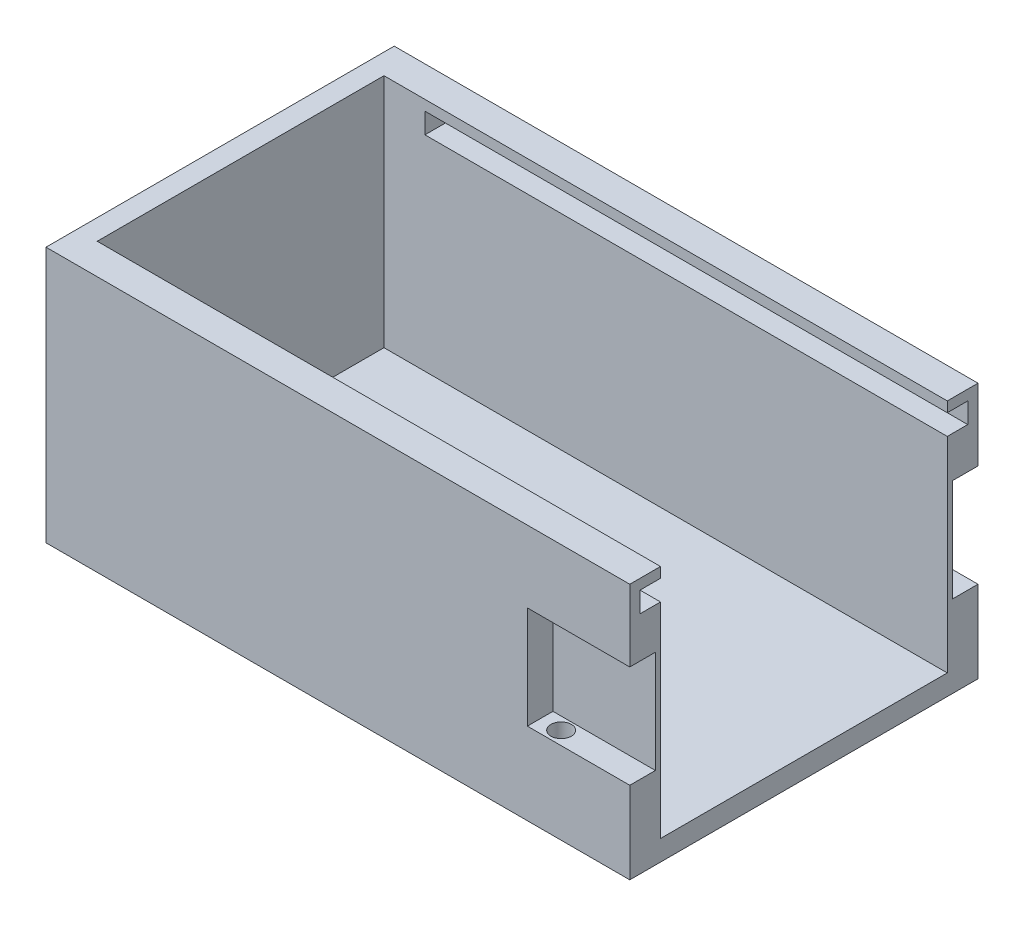
ISO-10303-21;
HEADER;
FILE_DESCRIPTION(('STEP AP214'),'2;1');
FILE_NAME('part.step','',(''),(''),'','','');
FILE_SCHEMA(('AUTOMOTIVE_DESIGN { 1 0 10303 214 1 1 1 1 }'));
ENDSEC;
DATA;
#1=APPLICATION_CONTEXT('core data for automotive mechanical design processes');
#2=APPLICATION_PROTOCOL_DEFINITION('international standard','automotive_design',2000,#1);
#3=PRODUCT_CONTEXT('',#1,'mechanical');
#4=PRODUCT('Part','Part','',(#3));
#5=PRODUCT_RELATED_PRODUCT_CATEGORY('part','',(#4));
#6=PRODUCT_DEFINITION_FORMATION('','',#4);
#7=PRODUCT_DEFINITION_CONTEXT('part definition',#1,'design');
#8=PRODUCT_DEFINITION('design','',#6,#7);
#9=PRODUCT_DEFINITION_SHAPE('','',#8);
#10=(LENGTH_UNIT() NAMED_UNIT(*) SI_UNIT(.MILLI.,.METRE.));
#11=(NAMED_UNIT(*) PLANE_ANGLE_UNIT() SI_UNIT($,.RADIAN.));
#12=(NAMED_UNIT(*) SI_UNIT($,.STERADIAN.) SOLID_ANGLE_UNIT());
#13=UNCERTAINTY_MEASURE_WITH_UNIT(LENGTH_MEASURE(1.E-05),#10,'distance_accuracy_value','');
#14=(GEOMETRIC_REPRESENTATION_CONTEXT(3) GLOBAL_UNCERTAINTY_ASSIGNED_CONTEXT((#13)) GLOBAL_UNIT_ASSIGNED_CONTEXT((#10,
#11,#12)) REPRESENTATION_CONTEXT('',''));
#15=CARTESIAN_POINT('',(0.,0.,0.));
#16=DIRECTION('',(0.,0.,1.));
#17=DIRECTION('',(1.,0.,0.));
#18=AXIS2_PLACEMENT_3D('',#15,#16,#17);
#19=CARTESIAN_POINT('',(0.,25.,0.));
#20=DIRECTION('',(0.,-1.,0.));
#21=DIRECTION('',(0.,0.,-1.));
#22=AXIS2_PLACEMENT_3D('',#19,#20,#21);
#23=PLANE('',#22);
#24=DIRECTION('',(1.,0.,0.));
#25=VECTOR('',#24,1.);
#26=CARTESIAN_POINT('',(0.,25.,0.));
#27=LINE('',#26,#25);
#28=CARTESIAN_POINT('',(0.,25.,0.));
#29=VERTEX_POINT('',#28);
#30=CARTESIAN_POINT('',(57.,25.,0.));
#31=VERTEX_POINT('',#30);
#32=EDGE_CURVE('E363',#29,#31,#27,.T.);
#33=ORIENTED_EDGE('',*,*,#32,.T.);
#34=DIRECTION('',(0.,0.,1.));
#35=VECTOR('',#34,1.);
#36=CARTESIAN_POINT('',(57.,25.,0.));
#37=LINE('',#36,#35);
#38=CARTESIAN_POINT('',(57.,25.,-3.));
#39=VERTEX_POINT('',#38);
#40=EDGE_CURVE('E281',#39,#31,#37,.T.);
#41=ORIENTED_EDGE('',*,*,#40,.F.);
#42=DIRECTION('',(1.,0.,0.));
#43=VECTOR('',#42,1.);
#44=CARTESIAN_POINT('',(2.,25.,-3.));
#45=LINE('',#44,#43);
#46=CARTESIAN_POINT('',(2.,25.,-3.));
#47=VERTEX_POINT('',#46);
#48=EDGE_CURVE('E342',#47,#39,#45,.T.);
#49=ORIENTED_EDGE('',*,*,#48,.F.);
#50=DIRECTION('',(0.,0.,1.));
#51=VECTOR('',#50,1.);
#52=CARTESIAN_POINT('',(2.,25.,-3.));
#53=LINE('',#52,#51);
#54=CARTESIAN_POINT('',(2.,25.,-31.));
#55=VERTEX_POINT('',#54);
#56=EDGE_CURVE('E339',#55,#47,#53,.T.);
#57=ORIENTED_EDGE('',*,*,#56,.F.);
#58=DIRECTION('',(-1.,0.,0.));
#59=VECTOR('',#58,1.);
#60=CARTESIAN_POINT('',(2.,25.,-31.));
#61=LINE('',#60,#59);
#62=CARTESIAN_POINT('',(57.,25.,-31.));
#63=VERTEX_POINT('',#62);
#64=EDGE_CURVE('E337',#63,#55,#61,.T.);
#65=ORIENTED_EDGE('',*,*,#64,.F.);
#66=CARTESIAN_POINT('',(57.,25.,-34.));
#67=VERTEX_POINT('',#66);
#68=EDGE_CURVE('E318',#67,#63,#37,.T.);
#69=ORIENTED_EDGE('',*,*,#68,.F.);
#70=DIRECTION('',(-1.,0.,0.));
#71=VECTOR('',#70,1.);
#72=CARTESIAN_POINT('',(0.,25.,-34.));
#73=LINE('',#72,#71);
#74=CARTESIAN_POINT('',(0.,25.,-34.));
#75=VERTEX_POINT('',#74);
#76=EDGE_CURVE('E367',#67,#75,#73,.T.);
#77=ORIENTED_EDGE('',*,*,#76,.T.);
#78=DIRECTION('',(0.,0.,1.));
#79=VECTOR('',#78,1.);
#80=CARTESIAN_POINT('',(0.,25.,0.));
#81=LINE('',#80,#79);
#82=EDGE_CURVE('E360',#75,#29,#81,.T.);
#83=ORIENTED_EDGE('',*,*,#82,.T.);
#84=EDGE_LOOP('',(#33,#41,#49,#57,#65,#69,#77,#83));
#85=FACE_BOUND('',#84,.T.);
#86=ADVANCED_FACE('F36',(#85),#23,.F.);
#87=CARTESIAN_POINT('',(0.,0.,0.));
#88=DIRECTION('',(0.,-1.,0.));
#89=DIRECTION('',(0.,0.,-1.));
#90=AXIS2_PLACEMENT_3D('',#87,#88,#89);
#91=PLANE('',#90);
#92=DIRECTION('',(0.,0.,1.));
#93=VECTOR('',#92,1.);
#94=CARTESIAN_POINT('',(57.,0.,0.));
#95=LINE('',#94,#93);
#96=CARTESIAN_POINT('',(57.,0.,-34.));
#97=VERTEX_POINT('',#96);
#98=CARTESIAN_POINT('',(57.,0.,0.));
#99=VERTEX_POINT('',#98);
#100=EDGE_CURVE('E314',#97,#99,#95,.T.);
#101=ORIENTED_EDGE('',*,*,#100,.T.);
#102=DIRECTION('',(1.,0.,0.));
#103=VECTOR('',#102,1.);
#104=CARTESIAN_POINT('',(0.,0.,0.));
#105=LINE('',#104,#103);
#106=CARTESIAN_POINT('',(0.,0.,0.));
#107=VERTEX_POINT('',#106);
#108=EDGE_CURVE('E371',#107,#99,#105,.T.);
#109=ORIENTED_EDGE('',*,*,#108,.F.);
#110=DIRECTION('',(0.,0.,1.));
#111=VECTOR('',#110,1.);
#112=CARTESIAN_POINT('',(0.,0.,0.));
#113=LINE('',#112,#111);
#114=CARTESIAN_POINT('',(0.,0.,-34.));
#115=VERTEX_POINT('',#114);
#116=EDGE_CURVE('E359',#115,#107,#113,.T.);
#117=ORIENTED_EDGE('',*,*,#116,.F.);
#118=DIRECTION('',(-1.,0.,0.));
#119=VECTOR('',#118,1.);
#120=CARTESIAN_POINT('',(0.,0.,-34.));
#121=LINE('',#120,#119);
#122=EDGE_CURVE('E364',#97,#115,#121,.T.);
#123=ORIENTED_EDGE('',*,*,#122,.F.);
#124=EDGE_LOOP('',(#101,#109,#117,#123));
#125=FACE_BOUND('',#124,.T.);
#126=ADVANCED_FACE('F412',(#125),#91,.T.);
#127=CARTESIAN_POINT('',(0.,25.,0.));
#128=DIRECTION('',(1.,0.,0.));
#129=DIRECTION('',(0.,0.,-1.));
#130=AXIS2_PLACEMENT_3D('',#127,#128,#129);
#131=PLANE('',#130);
#132=ORIENTED_EDGE('',*,*,#116,.T.);
#133=DIRECTION('',(0.,-1.,0.));
#134=VECTOR('',#133,1.);
#135=CARTESIAN_POINT('',(0.,25.,0.));
#136=LINE('',#135,#134);
#137=EDGE_CURVE('E11',#29,#107,#136,.T.);
#138=ORIENTED_EDGE('',*,*,#137,.F.);
#139=ORIENTED_EDGE('',*,*,#82,.F.);
#140=DIRECTION('',(0.,-1.,0.));
#141=VECTOR('',#140,1.);
#142=CARTESIAN_POINT('',(0.,25.,-34.));
#143=LINE('',#142,#141);
#144=EDGE_CURVE('E45',#75,#115,#143,.T.);
#145=ORIENTED_EDGE('',*,*,#144,.T.);
#146=EDGE_LOOP('',(#132,#138,#139,#145));
#147=FACE_BOUND('',#146,.T.);
#148=ADVANCED_FACE('F38',(#147),#131,.F.);
#149=CARTESIAN_POINT('',(0.,25.,0.));
#150=DIRECTION('',(0.,0.,-1.));
#151=DIRECTION('',(-1.,0.,0.));
#152=AXIS2_PLACEMENT_3D('',#149,#150,#151);
#153=PLANE('',#152);
#154=DIRECTION('',(0.,1.,0.));
#155=VECTOR('',#154,1.);
#156=CARTESIAN_POINT('',(57.,0.,0.));
#157=LINE('',#156,#155);
#158=CARTESIAN_POINT('',(57.,8.,0.));
#159=VERTEX_POINT('',#158);
#160=EDGE_CURVE('E320',#99,#159,#157,.T.);
#161=ORIENTED_EDGE('',*,*,#160,.T.);
#162=DIRECTION('',(1.,0.,0.));
#163=VECTOR('',#162,1.);
#164=CARTESIAN_POINT('',(57.,8.,0.));
#165=LINE('',#164,#163);
#166=CARTESIAN_POINT('',(47.,8.,0.));
#167=VERTEX_POINT('',#166);
#168=EDGE_CURVE('E217',#167,#159,#165,.T.);
#169=ORIENTED_EDGE('',*,*,#168,.F.);
#170=DIRECTION('',(0.,-1.,0.));
#171=VECTOR('',#170,1.);
#172=CARTESIAN_POINT('',(47.,18.,0.));
#173=LINE('',#172,#171);
#174=CARTESIAN_POINT('',(47.,18.,0.));
#175=VERTEX_POINT('',#174);
#176=EDGE_CURVE('E397',#175,#167,#173,.T.);
#177=ORIENTED_EDGE('',*,*,#176,.F.);
#178=DIRECTION('',(-1.,0.,0.));
#179=VECTOR('',#178,1.);
#180=CARTESIAN_POINT('',(57.,18.,0.));
#181=LINE('',#180,#179);
#182=CARTESIAN_POINT('',(57.,18.,0.));
#183=VERTEX_POINT('',#182);
#184=EDGE_CURVE('E383',#183,#175,#181,.T.);
#185=ORIENTED_EDGE('',*,*,#184,.F.);
#186=EDGE_CURVE('E222',#183,#31,#157,.T.);
#187=ORIENTED_EDGE('',*,*,#186,.T.);
#188=ORIENTED_EDGE('',*,*,#32,.F.);
#189=ORIENTED_EDGE('',*,*,#137,.T.);
#190=ORIENTED_EDGE('',*,*,#108,.T.);
#191=EDGE_LOOP('',(#161,#169,#177,#185,#187,#188,#189,#190));
#192=FACE_BOUND('',#191,.T.);
#193=ADVANCED_FACE('F408',(#192),#153,.F.);
#194=CARTESIAN_POINT('',(0.,25.,-34.));
#195=DIRECTION('',(0.,0.,1.));
#196=DIRECTION('',(1.,0.,0.));
#197=AXIS2_PLACEMENT_3D('',#194,#195,#196);
#198=PLANE('',#197);
#199=DIRECTION('',(0.,1.,0.));
#200=VECTOR('',#199,1.);
#201=CARTESIAN_POINT('',(57.,0.,-34.));
#202=LINE('',#201,#200);
#203=CARTESIAN_POINT('',(57.,18.,-34.));
#204=VERTEX_POINT('',#203);
#205=EDGE_CURVE('E317',#204,#67,#202,.T.);
#206=ORIENTED_EDGE('',*,*,#205,.F.);
#207=DIRECTION('',(1.,0.,0.));
#208=VECTOR('',#207,1.);
#209=CARTESIAN_POINT('',(57.,18.,-34.));
#210=LINE('',#209,#208);
#211=CARTESIAN_POINT('',(47.,18.,-34.));
#212=VERTEX_POINT('',#211);
#213=EDGE_CURVE('E232',#212,#204,#210,.T.);
#214=ORIENTED_EDGE('',*,*,#213,.F.);
#215=DIRECTION('',(0.,1.,0.));
#216=VECTOR('',#215,1.);
#217=CARTESIAN_POINT('',(47.,18.,-34.));
#218=LINE('',#217,#216);
#219=CARTESIAN_POINT('',(47.,8.,-34.));
#220=VERTEX_POINT('',#219);
#221=EDGE_CURVE('E242',#220,#212,#218,.T.);
#222=ORIENTED_EDGE('',*,*,#221,.F.);
#223=DIRECTION('',(-1.,0.,0.));
#224=VECTOR('',#223,1.);
#225=CARTESIAN_POINT('',(57.,8.,-34.));
#226=LINE('',#225,#224);
#227=CARTESIAN_POINT('',(57.,8.,-34.));
#228=VERTEX_POINT('',#227);
#229=EDGE_CURVE('E239',#228,#220,#226,.T.);
#230=ORIENTED_EDGE('',*,*,#229,.F.);
#231=EDGE_CURVE('E324',#97,#228,#202,.T.);
#232=ORIENTED_EDGE('',*,*,#231,.F.);
#233=ORIENTED_EDGE('',*,*,#122,.T.);
#234=ORIENTED_EDGE('',*,*,#144,.F.);
#235=ORIENTED_EDGE('',*,*,#76,.F.);
#236=EDGE_LOOP('',(#206,#214,#222,#230,#232,#233,#234,#235));
#237=FACE_BOUND('',#236,.T.);
#238=ADVANCED_FACE('F417',(#237),#198,.F.);
#239=CARTESIAN_POINT('',(2.,25.,-31.));
#240=DIRECTION('',(0.,0.,1.));
#241=DIRECTION('',(1.,0.,0.));
#242=AXIS2_PLACEMENT_3D('',#239,#240,#241);
#243=PLANE('',#242);
#244=DIRECTION('',(1.,0.,0.));
#245=VECTOR('',#244,1.);
#246=CARTESIAN_POINT('',(6.,24.,-31.));
#247=LINE('',#246,#245);
#248=CARTESIAN_POINT('',(6.,24.,-31.));
#249=VERTEX_POINT('',#248);
#250=CARTESIAN_POINT('',(57.,24.,-31.));
#251=VERTEX_POINT('',#250);
#252=EDGE_CURVE('E274',#249,#251,#247,.T.);
#253=ORIENTED_EDGE('',*,*,#252,.T.);
#254=DIRECTION('',(0.,-1.,0.));
#255=VECTOR('',#254,1.);
#256=CARTESIAN_POINT('',(57.,25.,-31.));
#257=LINE('',#256,#255);
#258=EDGE_CURVE('E356',#63,#251,#257,.T.);
#259=ORIENTED_EDGE('',*,*,#258,.F.);
#260=ORIENTED_EDGE('',*,*,#64,.T.);
#261=DIRECTION('',(0.,-1.,0.));
#262=VECTOR('',#261,1.);
#263=CARTESIAN_POINT('',(2.,25.,-31.));
#264=LINE('',#263,#262);
#265=CARTESIAN_POINT('',(2.,2.,-31.));
#266=VERTEX_POINT('',#265);
#267=EDGE_CURVE('E352',#55,#266,#264,.T.);
#268=ORIENTED_EDGE('',*,*,#267,.T.);
#269=DIRECTION('',(1.,0.,0.));
#270=VECTOR('',#269,1.);
#271=CARTESIAN_POINT('',(2.,2.,-31.));
#272=LINE('',#271,#270);
#273=CARTESIAN_POINT('',(57.,2.,-31.));
#274=VERTEX_POINT('',#273);
#275=EDGE_CURVE('E332',#266,#274,#272,.T.);
#276=ORIENTED_EDGE('',*,*,#275,.T.);
#277=CARTESIAN_POINT('',(57.,22.,-31.));
#278=VERTEX_POINT('',#277);
#279=EDGE_CURVE('E355',#278,#274,#257,.T.);
#280=ORIENTED_EDGE('',*,*,#279,.F.);
#281=DIRECTION('',(1.,0.,0.));
#282=VECTOR('',#281,1.);
#283=CARTESIAN_POINT('',(6.,22.,-31.));
#284=LINE('',#283,#282);
#285=CARTESIAN_POINT('',(6.,22.,-31.));
#286=VERTEX_POINT('',#285);
#287=EDGE_CURVE('E300',#286,#278,#284,.T.);
#288=ORIENTED_EDGE('',*,*,#287,.F.);
#289=DIRECTION('',(0.,-1.,0.));
#290=VECTOR('',#289,1.);
#291=CARTESIAN_POINT('',(6.,24.,-31.));
#292=LINE('',#291,#290);
#293=EDGE_CURVE('E287',#249,#286,#292,.T.);
#294=ORIENTED_EDGE('',*,*,#293,.F.);
#295=EDGE_LOOP('',(#253,#259,#260,#268,#276,#280,#288,#294));
#296=FACE_BOUND('',#295,.T.);
#297=ADVANCED_FACE('F459',(#296),#243,.T.);
#298=CARTESIAN_POINT('',(2.,25.,-3.));
#299=DIRECTION('',(1.,0.,0.));
#300=DIRECTION('',(0.,0.,-1.));
#301=AXIS2_PLACEMENT_3D('',#298,#299,#300);
#302=PLANE('',#301);
#303=DIRECTION('',(0.,0.,-1.));
#304=VECTOR('',#303,1.);
#305=CARTESIAN_POINT('',(2.,2.,-3.));
#306=LINE('',#305,#304);
#307=CARTESIAN_POINT('',(2.,2.,-3.));
#308=VERTEX_POINT('',#307);
#309=EDGE_CURVE('E335',#308,#266,#306,.T.);
#310=ORIENTED_EDGE('',*,*,#309,.T.);
#311=ORIENTED_EDGE('',*,*,#267,.F.);
#312=ORIENTED_EDGE('',*,*,#56,.T.);
#313=DIRECTION('',(0.,-1.,0.));
#314=VECTOR('',#313,1.);
#315=CARTESIAN_POINT('',(2.,25.,-3.));
#316=LINE('',#315,#314);
#317=EDGE_CURVE('E349',#47,#308,#316,.T.);
#318=ORIENTED_EDGE('',*,*,#317,.T.);
#319=EDGE_LOOP('',(#310,#311,#312,#318));
#320=FACE_BOUND('',#319,.T.);
#321=ADVANCED_FACE('F501',(#320),#302,.T.);
#322=CARTESIAN_POINT('',(2.,25.,-3.));
#323=DIRECTION('',(0.,0.,-1.));
#324=DIRECTION('',(-1.,0.,0.));
#325=AXIS2_PLACEMENT_3D('',#322,#323,#324);
#326=PLANE('',#325);
#327=DIRECTION('',(1.,0.,0.));
#328=VECTOR('',#327,1.);
#329=CARTESIAN_POINT('',(6.,22.,-3.));
#330=LINE('',#329,#328);
#331=CARTESIAN_POINT('',(6.,22.,-3.));
#332=VERTEX_POINT('',#331);
#333=CARTESIAN_POINT('',(57.,22.,-3.));
#334=VERTEX_POINT('',#333);
#335=EDGE_CURVE('E278',#332,#334,#330,.T.);
#336=ORIENTED_EDGE('',*,*,#335,.T.);
#337=DIRECTION('',(0.,-1.,0.));
#338=VECTOR('',#337,1.);
#339=CARTESIAN_POINT('',(57.,25.,-3.));
#340=LINE('',#339,#338);
#341=CARTESIAN_POINT('',(57.,2.,-3.));
#342=VERTEX_POINT('',#341);
#343=EDGE_CURVE('E345',#334,#342,#340,.T.);
#344=ORIENTED_EDGE('',*,*,#343,.T.);
#345=DIRECTION('',(1.,0.,0.));
#346=VECTOR('',#345,1.);
#347=CARTESIAN_POINT('',(2.,2.,-3.));
#348=LINE('',#347,#346);
#349=EDGE_CURVE('E323',#308,#342,#348,.T.);
#350=ORIENTED_EDGE('',*,*,#349,.F.);
#351=ORIENTED_EDGE('',*,*,#317,.F.);
#352=ORIENTED_EDGE('',*,*,#48,.T.);
#353=CARTESIAN_POINT('',(57.,24.,-3.));
#354=VERTEX_POINT('',#353);
#355=EDGE_CURVE('E346',#39,#354,#340,.T.);
#356=ORIENTED_EDGE('',*,*,#355,.T.);
#357=DIRECTION('',(1.,0.,0.));
#358=VECTOR('',#357,1.);
#359=CARTESIAN_POINT('',(6.,24.,-3.));
#360=LINE('',#359,#358);
#361=CARTESIAN_POINT('',(6.,24.,-3.));
#362=VERTEX_POINT('',#361);
#363=EDGE_CURVE('E269',#362,#354,#360,.T.);
#364=ORIENTED_EDGE('',*,*,#363,.F.);
#365=DIRECTION('',(0.,1.,0.));
#366=VECTOR('',#365,1.);
#367=CARTESIAN_POINT('',(6.,24.,-3.));
#368=LINE('',#367,#366);
#369=EDGE_CURVE('E256',#332,#362,#368,.T.);
#370=ORIENTED_EDGE('',*,*,#369,.F.);
#371=EDGE_LOOP('',(#336,#344,#350,#351,#352,#356,#364,#370));
#372=FACE_BOUND('',#371,.T.);
#373=ADVANCED_FACE('F488',(#372),#326,.T.);
#374=CARTESIAN_POINT('',(0.,2.,0.));
#375=DIRECTION('',(0.,1.,0.));
#376=DIRECTION('',(0.,0.,1.));
#377=AXIS2_PLACEMENT_3D('',#374,#375,#376);
#378=PLANE('',#377);
#379=ORIENTED_EDGE('',*,*,#349,.T.);
#380=DIRECTION('',(0.,0.,-1.));
#381=VECTOR('',#380,1.);
#382=CARTESIAN_POINT('',(57.,2.,-3.));
#383=LINE('',#382,#381);
#384=EDGE_CURVE('E329',#342,#274,#383,.T.);
#385=ORIENTED_EDGE('',*,*,#384,.T.);
#386=ORIENTED_EDGE('',*,*,#275,.F.);
#387=ORIENTED_EDGE('',*,*,#309,.F.);
#388=EDGE_LOOP('',(#379,#385,#386,#387));
#389=FACE_BOUND('',#388,.T.);
#390=ADVANCED_FACE('F484',(#389),#378,.T.);
#391=CARTESIAN_POINT('',(57.,0.,0.));
#392=DIRECTION('',(-1.,0.,0.));
#393=DIRECTION('',(0.,0.,1.));
#394=AXIS2_PLACEMENT_3D('',#391,#392,#393);
#395=PLANE('',#394);
#396=DIRECTION('',(0.,1.,0.));
#397=VECTOR('',#396,1.);
#398=CARTESIAN_POINT('',(57.,18.,-2.5));
#399=LINE('',#398,#397);
#400=CARTESIAN_POINT('',(57.,8.,-2.5));
#401=VERTEX_POINT('',#400);
#402=CARTESIAN_POINT('',(57.,18.,-2.5));
#403=VERTEX_POINT('',#402);
#404=EDGE_CURVE('E211',#401,#403,#399,.T.);
#405=ORIENTED_EDGE('',*,*,#404,.F.);
#406=DIRECTION('',(0.,0.,1.));
#407=VECTOR('',#406,1.);
#408=CARTESIAN_POINT('',(57.,8.,-2.5));
#409=LINE('',#408,#407);
#410=EDGE_CURVE('E243',#401,#159,#409,.T.);
#411=ORIENTED_EDGE('',*,*,#410,.T.);
#412=ORIENTED_EDGE('',*,*,#160,.F.);
#413=ORIENTED_EDGE('',*,*,#100,.F.);
#414=ORIENTED_EDGE('',*,*,#231,.T.);
#415=DIRECTION('',(0.,0.,-1.));
#416=VECTOR('',#415,1.);
#417=CARTESIAN_POINT('',(57.,8.,-31.5));
#418=LINE('',#417,#416);
#419=CARTESIAN_POINT('',(57.,8.,-31.5));
#420=VERTEX_POINT('',#419);
#421=EDGE_CURVE('E238',#420,#228,#418,.T.);
#422=ORIENTED_EDGE('',*,*,#421,.F.);
#423=DIRECTION('',(0.,-1.,0.));
#424=VECTOR('',#423,1.);
#425=CARTESIAN_POINT('',(57.,18.,-31.5));
#426=LINE('',#425,#424);
#427=CARTESIAN_POINT('',(57.,18.,-31.5));
#428=VERTEX_POINT('',#427);
#429=EDGE_CURVE('E229',#428,#420,#426,.T.);
#430=ORIENTED_EDGE('',*,*,#429,.F.);
#431=DIRECTION('',(0.,0.,-1.));
#432=VECTOR('',#431,1.);
#433=CARTESIAN_POINT('',(57.,18.,-31.5));
#434=LINE('',#433,#432);
#435=EDGE_CURVE('E247',#428,#204,#434,.T.);
#436=ORIENTED_EDGE('',*,*,#435,.T.);
#437=ORIENTED_EDGE('',*,*,#205,.T.);
#438=ORIENTED_EDGE('',*,*,#68,.T.);
#439=ORIENTED_EDGE('',*,*,#258,.T.);
#440=DIRECTION('',(0.,0.,1.));
#441=VECTOR('',#440,1.);
#442=CARTESIAN_POINT('',(57.,24.,-31.));
#443=LINE('',#442,#441);
#444=CARTESIAN_POINT('',(57.,24.,-33.));
#445=VERTEX_POINT('',#444);
#446=EDGE_CURVE('E291',#445,#251,#443,.T.);
#447=ORIENTED_EDGE('',*,*,#446,.F.);
#448=DIRECTION('',(0.,1.,0.));
#449=VECTOR('',#448,1.);
#450=CARTESIAN_POINT('',(57.,24.,-33.));
#451=LINE('',#450,#449);
#452=CARTESIAN_POINT('',(57.,22.,-33.));
#453=VERTEX_POINT('',#452);
#454=EDGE_CURVE('E303',#453,#445,#451,.T.);
#455=ORIENTED_EDGE('',*,*,#454,.F.);
#456=DIRECTION('',(0.,0.,-1.));
#457=VECTOR('',#456,1.);
#458=CARTESIAN_POINT('',(57.,22.,-31.));
#459=LINE('',#458,#457);
#460=EDGE_CURVE('E250',#278,#453,#459,.T.);
#461=ORIENTED_EDGE('',*,*,#460,.F.);
#462=ORIENTED_EDGE('',*,*,#279,.T.);
#463=ORIENTED_EDGE('',*,*,#384,.F.);
#464=ORIENTED_EDGE('',*,*,#343,.F.);
#465=DIRECTION('',(0.,0.,-1.));
#466=VECTOR('',#465,1.);
#467=CARTESIAN_POINT('',(57.,22.,-3.));
#468=LINE('',#467,#466);
#469=CARTESIAN_POINT('',(57.,22.,-1.));
#470=VERTEX_POINT('',#469);
#471=EDGE_CURVE('E260',#470,#334,#468,.T.);
#472=ORIENTED_EDGE('',*,*,#471,.F.);
#473=DIRECTION('',(0.,-1.,0.));
#474=VECTOR('',#473,1.);
#475=CARTESIAN_POINT('',(57.,24.,-1.));
#476=LINE('',#475,#474);
#477=CARTESIAN_POINT('',(57.,24.,-1.));
#478=VERTEX_POINT('',#477);
#479=EDGE_CURVE('E273',#478,#470,#476,.T.);
#480=ORIENTED_EDGE('',*,*,#479,.F.);
#481=DIRECTION('',(0.,0.,1.));
#482=VECTOR('',#481,1.);
#483=CARTESIAN_POINT('',(57.,24.,-3.));
#484=LINE('',#483,#482);
#485=EDGE_CURVE('E270',#354,#478,#484,.T.);
#486=ORIENTED_EDGE('',*,*,#485,.F.);
#487=ORIENTED_EDGE('',*,*,#355,.F.);
#488=ORIENTED_EDGE('',*,*,#40,.T.);
#489=ORIENTED_EDGE('',*,*,#186,.F.);
#490=DIRECTION('',(0.,0.,1.));
#491=VECTOR('',#490,1.);
#492=CARTESIAN_POINT('',(57.,18.,-2.5));
#493=LINE('',#492,#491);
#494=EDGE_CURVE('E206',#403,#183,#493,.T.);
#495=ORIENTED_EDGE('',*,*,#494,.F.);
#496=EDGE_LOOP('',(#405,#411,#412,#413,#414,#422,#430,#436,#437,#438,#439,#447,#455,#461,#462,
#463,#464,#472,#480,#486,#487,#488,#489,#495));
#497=FACE_BOUND('',#496,.T.);
#498=ADVANCED_FACE('F220',(#497),#395,.F.);
#499=CARTESIAN_POINT('',(6.,24.,-31.));
#500=DIRECTION('',(0.,1.,0.));
#501=DIRECTION('',(0.,0.,1.));
#502=AXIS2_PLACEMENT_3D('',#499,#500,#501);
#503=PLANE('',#502);
#504=ORIENTED_EDGE('',*,*,#446,.T.);
#505=ORIENTED_EDGE('',*,*,#252,.F.);
#506=DIRECTION('',(0.,0.,1.));
#507=VECTOR('',#506,1.);
#508=CARTESIAN_POINT('',(6.,24.,-31.));
#509=LINE('',#508,#507);
#510=CARTESIAN_POINT('',(6.,24.,-33.));
#511=VERTEX_POINT('',#510);
#512=EDGE_CURVE('E297',#511,#249,#509,.T.);
#513=ORIENTED_EDGE('',*,*,#512,.F.);
#514=DIRECTION('',(1.,0.,0.));
#515=VECTOR('',#514,1.);
#516=CARTESIAN_POINT('',(6.,24.,-33.));
#517=LINE('',#516,#515);
#518=EDGE_CURVE('E309',#511,#445,#517,.T.);
#519=ORIENTED_EDGE('',*,*,#518,.T.);
#520=EDGE_LOOP('',(#504,#505,#513,#519));
#521=FACE_BOUND('',#520,.T.);
#522=ADVANCED_FACE('F516',(#521),#503,.F.);
#523=CARTESIAN_POINT('',(6.,24.,-33.));
#524=DIRECTION('',(0.,0.,-1.));
#525=DIRECTION('',(-1.,0.,0.));
#526=AXIS2_PLACEMENT_3D('',#523,#524,#525);
#527=PLANE('',#526);
#528=ORIENTED_EDGE('',*,*,#454,.T.);
#529=ORIENTED_EDGE('',*,*,#518,.F.);
#530=DIRECTION('',(0.,1.,0.));
#531=VECTOR('',#530,1.);
#532=CARTESIAN_POINT('',(6.,24.,-33.));
#533=LINE('',#532,#531);
#534=CARTESIAN_POINT('',(6.,22.,-33.));
#535=VERTEX_POINT('',#534);
#536=EDGE_CURVE('E294',#535,#511,#533,.T.);
#537=ORIENTED_EDGE('',*,*,#536,.F.);
#538=DIRECTION('',(1.,0.,0.));
#539=VECTOR('',#538,1.);
#540=CARTESIAN_POINT('',(6.,22.,-33.));
#541=LINE('',#540,#539);
#542=EDGE_CURVE('E311',#535,#453,#541,.T.);
#543=ORIENTED_EDGE('',*,*,#542,.T.);
#544=EDGE_LOOP('',(#528,#529,#537,#543));
#545=FACE_BOUND('',#544,.T.);
#546=ADVANCED_FACE('F521',(#545),#527,.F.);
#547=CARTESIAN_POINT('',(6.,22.,-31.));
#548=DIRECTION('',(0.,-1.,0.));
#549=DIRECTION('',(0.,0.,-1.));
#550=AXIS2_PLACEMENT_3D('',#547,#548,#549);
#551=PLANE('',#550);
#552=ORIENTED_EDGE('',*,*,#460,.T.);
#553=ORIENTED_EDGE('',*,*,#542,.F.);
#554=DIRECTION('',(0.,0.,-1.));
#555=VECTOR('',#554,1.);
#556=CARTESIAN_POINT('',(6.,22.,-31.));
#557=LINE('',#556,#555);
#558=EDGE_CURVE('E290',#286,#535,#557,.T.);
#559=ORIENTED_EDGE('',*,*,#558,.F.);
#560=ORIENTED_EDGE('',*,*,#287,.T.);
#561=EDGE_LOOP('',(#552,#553,#559,#560));
#562=FACE_BOUND('',#561,.T.);
#563=ADVANCED_FACE('F531',(#562),#551,.F.);
#564=CARTESIAN_POINT('',(6.,0.,0.));
#565=DIRECTION('',(1.,0.,0.));
#566=DIRECTION('',(0.,0.,-1.));
#567=AXIS2_PLACEMENT_3D('',#564,#565,#566);
#568=PLANE('',#567);
#569=ORIENTED_EDGE('',*,*,#293,.T.);
#570=ORIENTED_EDGE('',*,*,#558,.T.);
#571=ORIENTED_EDGE('',*,*,#536,.T.);
#572=ORIENTED_EDGE('',*,*,#512,.T.);
#573=EDGE_LOOP('',(#569,#570,#571,#572));
#574=FACE_BOUND('',#573,.T.);
#575=ADVANCED_FACE('F541',(#574),#568,.T.);
#576=CARTESIAN_POINT('',(6.,22.,-3.));
#577=DIRECTION('',(0.,-1.,0.));
#578=DIRECTION('',(0.,0.,-1.));
#579=AXIS2_PLACEMENT_3D('',#576,#577,#578);
#580=PLANE('',#579);
#581=ORIENTED_EDGE('',*,*,#471,.T.);
#582=ORIENTED_EDGE('',*,*,#335,.F.);
#583=DIRECTION('',(0.,0.,-1.));
#584=VECTOR('',#583,1.);
#585=CARTESIAN_POINT('',(6.,22.,-3.));
#586=LINE('',#585,#584);
#587=CARTESIAN_POINT('',(6.,22.,-1.));
#588=VERTEX_POINT('',#587);
#589=EDGE_CURVE('E266',#588,#332,#586,.T.);
#590=ORIENTED_EDGE('',*,*,#589,.F.);
#591=DIRECTION('',(1.,0.,0.));
#592=VECTOR('',#591,1.);
#593=CARTESIAN_POINT('',(6.,22.,-1.));
#594=LINE('',#593,#592);
#595=EDGE_CURVE('E282',#588,#470,#594,.T.);
#596=ORIENTED_EDGE('',*,*,#595,.T.);
#597=EDGE_LOOP('',(#581,#582,#590,#596));
#598=FACE_BOUND('',#597,.T.);
#599=ADVANCED_FACE('F551',(#598),#580,.F.);
#600=CARTESIAN_POINT('',(6.,24.,-1.));
#601=DIRECTION('',(0.,0.,1.));
#602=DIRECTION('',(1.,0.,0.));
#603=AXIS2_PLACEMENT_3D('',#600,#601,#602);
#604=PLANE('',#603);
#605=ORIENTED_EDGE('',*,*,#479,.T.);
#606=ORIENTED_EDGE('',*,*,#595,.F.);
#607=DIRECTION('',(0.,-1.,0.));
#608=VECTOR('',#607,1.);
#609=CARTESIAN_POINT('',(6.,24.,-1.));
#610=LINE('',#609,#608);
#611=CARTESIAN_POINT('',(6.,24.,-1.));
#612=VERTEX_POINT('',#611);
#613=EDGE_CURVE('E263',#612,#588,#610,.T.);
#614=ORIENTED_EDGE('',*,*,#613,.F.);
#615=DIRECTION('',(1.,0.,0.));
#616=VECTOR('',#615,1.);
#617=CARTESIAN_POINT('',(6.,24.,-1.));
#618=LINE('',#617,#616);
#619=EDGE_CURVE('E284',#612,#478,#618,.T.);
#620=ORIENTED_EDGE('',*,*,#619,.T.);
#621=EDGE_LOOP('',(#605,#606,#614,#620));
#622=FACE_BOUND('',#621,.T.);
#623=ADVANCED_FACE('F561',(#622),#604,.F.);
#624=CARTESIAN_POINT('',(6.,24.,-3.));
#625=DIRECTION('',(0.,1.,0.));
#626=DIRECTION('',(0.,0.,1.));
#627=AXIS2_PLACEMENT_3D('',#624,#625,#626);
#628=PLANE('',#627);
#629=ORIENTED_EDGE('',*,*,#485,.T.);
#630=ORIENTED_EDGE('',*,*,#619,.F.);
#631=DIRECTION('',(0.,0.,1.));
#632=VECTOR('',#631,1.);
#633=CARTESIAN_POINT('',(6.,24.,-3.));
#634=LINE('',#633,#632);
#635=EDGE_CURVE('E259',#362,#612,#634,.T.);
#636=ORIENTED_EDGE('',*,*,#635,.F.);
#637=ORIENTED_EDGE('',*,*,#363,.T.);
#638=EDGE_LOOP('',(#629,#630,#636,#637));
#639=FACE_BOUND('',#638,.T.);
#640=ADVANCED_FACE('F571',(#639),#628,.F.);
#641=CARTESIAN_POINT('',(6.,0.,0.));
#642=DIRECTION('',(-1.,0.,0.));
#643=DIRECTION('',(0.,0.,1.));
#644=AXIS2_PLACEMENT_3D('',#641,#642,#643);
#645=PLANE('',#644);
#646=ORIENTED_EDGE('',*,*,#369,.T.);
#647=ORIENTED_EDGE('',*,*,#635,.T.);
#648=ORIENTED_EDGE('',*,*,#613,.T.);
#649=ORIENTED_EDGE('',*,*,#589,.T.);
#650=EDGE_LOOP('',(#646,#647,#648,#649));
#651=FACE_BOUND('',#650,.T.);
#652=ADVANCED_FACE('F581',(#651),#645,.F.);
#653=CARTESIAN_POINT('',(57.,18.,-31.5));
#654=DIRECTION('',(0.,1.,0.));
#655=DIRECTION('',(0.,0.,1.));
#656=AXIS2_PLACEMENT_3D('',#653,#654,#655);
#657=PLANE('',#656);
#658=CARTESIAN_POINT('',(48.8,18.,-32.7));
#659=DIRECTION('',(0.,1.,0.));
#660=DIRECTION('',(0.,0.,1.));
#661=AXIS2_PLACEMENT_3D('',#658,#659,#660);
#662=CIRCLE('',#661,0.999999999999998);
#663=CARTESIAN_POINT('',(48.8,18.,-31.7));
#664=VERTEX_POINT('',#663);
#665=EDGE_CURVE('E391',#664,#664,#662,.F.);
#666=ORIENTED_EDGE('',*,*,#665,.F.);
#667=EDGE_LOOP('',(#666));
#668=FACE_BOUND('',#667,.T.);
#669=ORIENTED_EDGE('',*,*,#213,.T.);
#670=ORIENTED_EDGE('',*,*,#435,.F.);
#671=DIRECTION('',(1.,0.,0.));
#672=VECTOR('',#671,1.);
#673=CARTESIAN_POINT('',(57.,18.,-31.5));
#674=LINE('',#673,#672);
#675=CARTESIAN_POINT('',(47.,18.,-31.5));
#676=VERTEX_POINT('',#675);
#677=EDGE_CURVE('E61',#676,#428,#674,.T.);
#678=ORIENTED_EDGE('',*,*,#677,.F.);
#679=DIRECTION('',(0.,0.,-1.));
#680=VECTOR('',#679,1.);
#681=CARTESIAN_POINT('',(47.,18.,-31.5));
#682=LINE('',#681,#680);
#683=EDGE_CURVE('E251',#676,#212,#682,.T.);
#684=ORIENTED_EDGE('',*,*,#683,.T.);
#685=EDGE_LOOP('',(#669,#670,#678,#684));
#686=FACE_BOUND('',#685,.T.);
#687=ADVANCED_FACE('F433',(#668,#686),#657,.F.);
#688=CARTESIAN_POINT('',(47.,18.,-31.5));
#689=DIRECTION('',(-1.,0.,0.));
#690=DIRECTION('',(0.,0.,1.));
#691=AXIS2_PLACEMENT_3D('',#688,#689,#690);
#692=PLANE('',#691);
#693=ORIENTED_EDGE('',*,*,#221,.T.);
#694=ORIENTED_EDGE('',*,*,#683,.F.);
#695=DIRECTION('',(0.,1.,0.));
#696=VECTOR('',#695,1.);
#697=CARTESIAN_POINT('',(47.,18.,-31.5));
#698=LINE('',#697,#696);
#699=CARTESIAN_POINT('',(47.,8.,-31.5));
#700=VERTEX_POINT('',#699);
#701=EDGE_CURVE('E235',#700,#676,#698,.T.);
#702=ORIENTED_EDGE('',*,*,#701,.F.);
#703=DIRECTION('',(0.,0.,-1.));
#704=VECTOR('',#703,1.);
#705=CARTESIAN_POINT('',(47.,8.,-31.5));
#706=LINE('',#705,#704);
#707=EDGE_CURVE('E253',#700,#220,#706,.T.);
#708=ORIENTED_EDGE('',*,*,#707,.T.);
#709=EDGE_LOOP('',(#693,#694,#702,#708));
#710=FACE_BOUND('',#709,.T.);
#711=ADVANCED_FACE('F436',(#710),#692,.F.);
#712=CARTESIAN_POINT('',(57.,8.,-31.5));
#713=DIRECTION('',(0.,-1.,0.));
#714=DIRECTION('',(0.,0.,-1.));
#715=AXIS2_PLACEMENT_3D('',#712,#713,#714);
#716=PLANE('',#715);
#717=CARTESIAN_POINT('',(48.8,8.,-32.7));
#718=DIRECTION('',(0.,-1.,0.));
#719=DIRECTION('',(0.,0.,-1.));
#720=AXIS2_PLACEMENT_3D('',#717,#718,#719);
#721=CIRCLE('',#720,0.999999999999998);
#722=CARTESIAN_POINT('',(48.8,8.,-33.7));
#723=VERTEX_POINT('',#722);
#724=EDGE_CURVE('E40',#723,#723,#721,.F.);
#725=ORIENTED_EDGE('',*,*,#724,.F.);
#726=EDGE_LOOP('',(#725));
#727=FACE_BOUND('',#726,.T.);
#728=ORIENTED_EDGE('',*,*,#229,.T.);
#729=ORIENTED_EDGE('',*,*,#707,.F.);
#730=DIRECTION('',(-1.,0.,0.));
#731=VECTOR('',#730,1.);
#732=CARTESIAN_POINT('',(57.,8.,-31.5));
#733=LINE('',#732,#731);
#734=EDGE_CURVE('E231',#420,#700,#733,.T.);
#735=ORIENTED_EDGE('',*,*,#734,.F.);
#736=ORIENTED_EDGE('',*,*,#421,.T.);
#737=EDGE_LOOP('',(#728,#729,#735,#736));
#738=FACE_BOUND('',#737,.T.);
#739=ADVANCED_FACE('F438',(#727,#738),#716,.F.);
#740=CARTESIAN_POINT('',(0.,0.,-31.5));
#741=DIRECTION('',(0.,0.,-1.));
#742=DIRECTION('',(-1.,0.,0.));
#743=AXIS2_PLACEMENT_3D('',#740,#741,#742);
#744=PLANE('',#743);
#745=ORIENTED_EDGE('',*,*,#429,.T.);
#746=ORIENTED_EDGE('',*,*,#734,.T.);
#747=ORIENTED_EDGE('',*,*,#701,.T.);
#748=ORIENTED_EDGE('',*,*,#677,.T.);
#749=EDGE_LOOP('',(#745,#746,#747,#748));
#750=FACE_BOUND('',#749,.T.);
#751=ADVANCED_FACE('F439',(#750),#744,.T.);
#752=CARTESIAN_POINT('',(57.,8.,-2.5));
#753=DIRECTION('',(0.,-1.,0.));
#754=DIRECTION('',(1.,0.,0.));
#755=AXIS2_PLACEMENT_3D('',#752,#753,#754);
#756=PLANE('',#755);
#757=CARTESIAN_POINT('',(49.,8.,-1.3));
#758=DIRECTION('',(0.,-1.,0.));
#759=DIRECTION('',(1.,0.,0.));
#760=AXIS2_PLACEMENT_3D('',#757,#758,#759);
#761=CIRCLE('',#760,0.999999999999998);
#762=CARTESIAN_POINT('',(50.,8.,-1.3));
#763=VERTEX_POINT('',#762);
#764=EDGE_CURVE('E378',#763,#763,#761,.F.);
#765=ORIENTED_EDGE('',*,*,#764,.F.);
#766=EDGE_LOOP('',(#765));
#767=FACE_BOUND('',#766,.T.);
#768=ORIENTED_EDGE('',*,*,#168,.T.);
#769=ORIENTED_EDGE('',*,*,#410,.F.);
#770=DIRECTION('',(1.,0.,0.));
#771=VECTOR('',#770,1.);
#772=CARTESIAN_POINT('',(57.,8.,-2.5));
#773=LINE('',#772,#771);
#774=CARTESIAN_POINT('',(47.,8.,-2.5));
#775=VERTEX_POINT('',#774);
#776=EDGE_CURVE('E53',#775,#401,#773,.T.);
#777=ORIENTED_EDGE('',*,*,#776,.F.);
#778=DIRECTION('',(0.,0.,1.));
#779=VECTOR('',#778,1.);
#780=CARTESIAN_POINT('',(47.,8.,-2.5));
#781=LINE('',#780,#779);
#782=EDGE_CURVE('E224',#775,#167,#781,.T.);
#783=ORIENTED_EDGE('',*,*,#782,.T.);
#784=EDGE_LOOP('',(#768,#769,#777,#783));
#785=FACE_BOUND('',#784,.T.);
#786=ADVANCED_FACE('F402',(#767,#785),#756,.F.);
#787=CARTESIAN_POINT('',(47.,18.,-2.5));
#788=DIRECTION('',(-1.,0.,0.));
#789=DIRECTION('',(0.,0.,1.));
#790=AXIS2_PLACEMENT_3D('',#787,#788,#789);
#791=PLANE('',#790);
#792=ORIENTED_EDGE('',*,*,#176,.T.);
#793=ORIENTED_EDGE('',*,*,#782,.F.);
#794=DIRECTION('',(0.,-1.,0.));
#795=VECTOR('',#794,1.);
#796=CARTESIAN_POINT('',(47.,18.,-2.5));
#797=LINE('',#796,#795);
#798=CARTESIAN_POINT('',(47.,18.,-2.5));
#799=VERTEX_POINT('',#798);
#800=EDGE_CURVE('E210',#799,#775,#797,.T.);
#801=ORIENTED_EDGE('',*,*,#800,.F.);
#802=DIRECTION('',(0.,0.,1.));
#803=VECTOR('',#802,1.);
#804=CARTESIAN_POINT('',(47.,18.,-2.5));
#805=LINE('',#804,#803);
#806=EDGE_CURVE('E208',#799,#175,#805,.T.);
#807=ORIENTED_EDGE('',*,*,#806,.T.);
#808=EDGE_LOOP('',(#792,#793,#801,#807));
#809=FACE_BOUND('',#808,.T.);
#810=ADVANCED_FACE('F406',(#809),#791,.F.);
#811=CARTESIAN_POINT('',(57.,18.,-2.5));
#812=DIRECTION('',(0.,1.,0.));
#813=DIRECTION('',(0.,0.,1.));
#814=AXIS2_PLACEMENT_3D('',#811,#812,#813);
#815=PLANE('',#814);
#816=CARTESIAN_POINT('',(49.,18.,-1.3));
#817=DIRECTION('',(0.,1.,0.));
#818=DIRECTION('',(0.,0.,1.));
#819=AXIS2_PLACEMENT_3D('',#816,#817,#818);
#820=CIRCLE('',#819,0.999999999999998);
#821=CARTESIAN_POINT('',(49.,18.,-0.300000000000002));
#822=VERTEX_POINT('',#821);
#823=EDGE_CURVE('E376',#822,#822,#820,.F.);
#824=ORIENTED_EDGE('',*,*,#823,.F.);
#825=EDGE_LOOP('',(#824));
#826=FACE_BOUND('',#825,.T.);
#827=ORIENTED_EDGE('',*,*,#184,.T.);
#828=ORIENTED_EDGE('',*,*,#806,.F.);
#829=DIRECTION('',(-1.,0.,0.));
#830=VECTOR('',#829,1.);
#831=CARTESIAN_POINT('',(57.,18.,-2.5));
#832=LINE('',#831,#830);
#833=EDGE_CURVE('E202',#403,#799,#832,.T.);
#834=ORIENTED_EDGE('',*,*,#833,.F.);
#835=ORIENTED_EDGE('',*,*,#494,.T.);
#836=EDGE_LOOP('',(#827,#828,#834,#835));
#837=FACE_BOUND('',#836,.T.);
#838=ADVANCED_FACE('F204',(#826,#837),#815,.F.);
#839=CARTESIAN_POINT('',(0.,0.,-2.5));
#840=DIRECTION('',(0.,0.,-1.));
#841=DIRECTION('',(-1.,0.,0.));
#842=AXIS2_PLACEMENT_3D('',#839,#840,#841);
#843=PLANE('',#842);
#844=ORIENTED_EDGE('',*,*,#404,.T.);
#845=ORIENTED_EDGE('',*,*,#833,.T.);
#846=ORIENTED_EDGE('',*,*,#800,.T.);
#847=ORIENTED_EDGE('',*,*,#776,.T.);
#848=EDGE_LOOP('',(#844,#845,#846,#847));
#849=FACE_BOUND('',#848,.T.);
#850=ADVANCED_FACE('F214',(#849),#843,.F.);
#851=CARTESIAN_POINT('',(49.,20.5,-1.3));
#852=DIRECTION('',(0.,-1.,0.));
#853=DIRECTION('',(0.,0.,-1.));
#854=AXIS2_PLACEMENT_3D('',#851,#852,#853);
#855=PLANE('',#854);
#856=CARTESIAN_POINT('',(49.,20.5,-1.3));
#857=DIRECTION('',(0.,-1.,0.));
#858=DIRECTION('',(0.,0.,-1.));
#859=AXIS2_PLACEMENT_3D('',#856,#857,#858);
#860=CIRCLE('',#859,0.999999999999998);
#861=CARTESIAN_POINT('',(49.,20.5,-2.3));
#862=VERTEX_POINT('',#861);
#863=EDGE_CURVE('E386',#862,#862,#860,.T.);
#864=ORIENTED_EDGE('',*,*,#863,.T.);
#865=EDGE_LOOP('',(#864));
#866=FACE_BOUND('',#865,.T.);
#867=ADVANCED_FACE('F643',(#866),#855,.T.);
#868=CARTESIAN_POINT('',(49.,5.5,-1.3));
#869=DIRECTION('',(0.,1.,0.));
#870=DIRECTION('',(0.,0.,1.));
#871=AXIS2_PLACEMENT_3D('',#868,#869,#870);
#872=CYLINDRICAL_SURFACE('',#871,0.999999999999998);
#873=ORIENTED_EDGE('',*,*,#863,.F.);
#874=EDGE_LOOP('',(#873));
#875=FACE_BOUND('',#874,.T.);
#876=ORIENTED_EDGE('',*,*,#823,.T.);
#877=EDGE_LOOP('',(#876));
#878=FACE_BOUND('',#877,.T.);
#879=ADVANCED_FACE('F663',(#875,#878),#872,.F.);
#880=CARTESIAN_POINT('',(49.,5.5,-1.3));
#881=DIRECTION('',(0.,-1.,0.));
#882=DIRECTION('',(0.,0.,-1.));
#883=AXIS2_PLACEMENT_3D('',#880,#881,#882);
#884=CIRCLE('',#883,0.999999999999998);
#885=CARTESIAN_POINT('',(49.,5.5,-2.3));
#886=VERTEX_POINT('',#885);
#887=EDGE_CURVE('E379',#886,#886,#884,.T.);
#888=ORIENTED_EDGE('',*,*,#887,.T.);
#889=EDGE_LOOP('',(#888));
#890=FACE_BOUND('',#889,.T.);
#891=ORIENTED_EDGE('',*,*,#764,.T.);
#892=EDGE_LOOP('',(#891));
#893=FACE_BOUND('',#892,.T.);
#894=ADVANCED_FACE('F673',(#890,#893),#872,.F.);
#895=CARTESIAN_POINT('',(49.,5.5,-1.3));
#896=DIRECTION('',(0.,-1.,0.));
#897=DIRECTION('',(0.,0.,-1.));
#898=AXIS2_PLACEMENT_3D('',#895,#896,#897);
#899=PLANE('',#898);
#900=ORIENTED_EDGE('',*,*,#887,.F.);
#901=EDGE_LOOP('',(#900));
#902=FACE_BOUND('',#901,.T.);
#903=ADVANCED_FACE('F683',(#902),#899,.F.);
#904=CARTESIAN_POINT('',(48.8,5.5,-32.7));
#905=DIRECTION('',(0.,-1.,0.));
#906=DIRECTION('',(0.,0.,-1.));
#907=AXIS2_PLACEMENT_3D('',#904,#905,#906);
#908=PLANE('',#907);
#909=CARTESIAN_POINT('',(48.8,5.5,-32.7));
#910=DIRECTION('',(0.,-1.,0.));
#911=DIRECTION('',(0.,0.,-1.));
#912=AXIS2_PLACEMENT_3D('',#909,#910,#911);
#913=CIRCLE('',#912,0.999999999999998);
#914=CARTESIAN_POINT('',(48.8,5.5,-33.7));
#915=VERTEX_POINT('',#914);
#916=EDGE_CURVE('E748',#915,#915,#913,.T.);
#917=ORIENTED_EDGE('',*,*,#916,.F.);
#918=EDGE_LOOP('',(#917));
#919=FACE_BOUND('',#918,.T.);
#920=ADVANCED_FACE('F691',(#919),#908,.F.);
#921=CARTESIAN_POINT('',(48.8,5.5,-32.7));
#922=DIRECTION('',(0.,1.,0.));
#923=DIRECTION('',(0.,0.,1.));
#924=AXIS2_PLACEMENT_3D('',#921,#922,#923);
#925=CYLINDRICAL_SURFACE('',#924,0.999999999999998);
#926=ORIENTED_EDGE('',*,*,#916,.T.);
#927=EDGE_LOOP('',(#926));
#928=FACE_BOUND('',#927,.T.);
#929=ORIENTED_EDGE('',*,*,#724,.T.);
#930=EDGE_LOOP('',(#929));
#931=FACE_BOUND('',#930,.T.);
#932=ADVANCED_FACE('F712',(#928,#931),#925,.F.);
#933=CARTESIAN_POINT('',(48.8,20.5,-32.7));
#934=DIRECTION('',(0.,-1.,0.));
#935=DIRECTION('',(0.,0.,-1.));
#936=AXIS2_PLACEMENT_3D('',#933,#934,#935);
#937=CIRCLE('',#936,0.999999999999998);
#938=CARTESIAN_POINT('',(48.8,20.5,-33.7));
#939=VERTEX_POINT('',#938);
#940=EDGE_CURVE('E747',#939,#939,#937,.T.);
#941=ORIENTED_EDGE('',*,*,#940,.F.);
#942=EDGE_LOOP('',(#941));
#943=FACE_BOUND('',#942,.T.);
#944=ORIENTED_EDGE('',*,*,#665,.T.);
#945=EDGE_LOOP('',(#944));
#946=FACE_BOUND('',#945,.T.);
#947=ADVANCED_FACE('F722',(#943,#946),#925,.F.);
#948=CARTESIAN_POINT('',(48.8,20.5,-32.7));
#949=DIRECTION('',(0.,-1.,0.));
#950=DIRECTION('',(0.,0.,-1.));
#951=AXIS2_PLACEMENT_3D('',#948,#949,#950);
#952=PLANE('',#951);
#953=ORIENTED_EDGE('',*,*,#940,.T.);
#954=EDGE_LOOP('',(#953));
#955=FACE_BOUND('',#954,.T.);
#956=ADVANCED_FACE('F732',(#955),#952,.T.);
#957=CLOSED_SHELL('',(#86,#126,#148,#193,#238,#297,#321,#373,#390,#498,#522,#546,#563,#575,#599,
#623,#640,#652,#687,#711,#739,#751,#786,#810,#838,#850,#867,#879,#894,#903,#920,#932,#947,#956));
#958=MANIFOLD_SOLID_BREP('B2',#957);
#959=ADVANCED_BREP_SHAPE_REPRESENTATION('',(#18,#958),#14);
#960=SHAPE_DEFINITION_REPRESENTATION(#9,#959);
ENDSEC;
END-ISO-10303-21;
